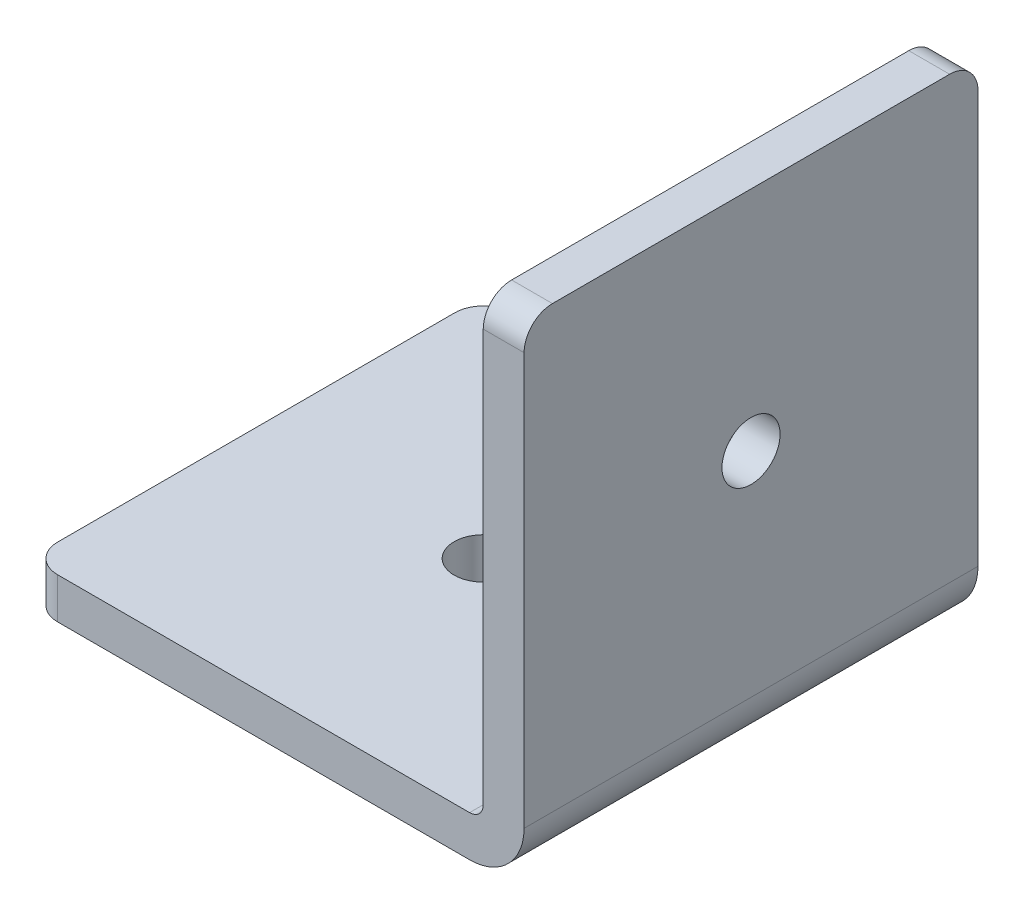
ISO-10303-21;
HEADER;
FILE_DESCRIPTION(('STEP AP214'),'2;1');
FILE_NAME('part.step','',(''),(''),'','','');
FILE_SCHEMA(('AUTOMOTIVE_DESIGN { 1 0 10303 214 1 1 1 1 }'));
ENDSEC;
DATA;
#1=APPLICATION_CONTEXT('core data for automotive mechanical design processes');
#2=APPLICATION_PROTOCOL_DEFINITION('international standard','automotive_design',2000,#1);
#3=PRODUCT_CONTEXT('',#1,'mechanical');
#4=PRODUCT('Part','Part','',(#3));
#5=PRODUCT_RELATED_PRODUCT_CATEGORY('part','',(#4));
#6=PRODUCT_DEFINITION_FORMATION('','',#4);
#7=PRODUCT_DEFINITION_CONTEXT('part definition',#1,'design');
#8=PRODUCT_DEFINITION('design','',#6,#7);
#9=PRODUCT_DEFINITION_SHAPE('','',#8);
#10=(LENGTH_UNIT() NAMED_UNIT(*) SI_UNIT(.MILLI.,.METRE.));
#11=(NAMED_UNIT(*) PLANE_ANGLE_UNIT() SI_UNIT($,.RADIAN.));
#12=(NAMED_UNIT(*) SI_UNIT($,.STERADIAN.) SOLID_ANGLE_UNIT());
#13=UNCERTAINTY_MEASURE_WITH_UNIT(LENGTH_MEASURE(1.E-05),#10,'distance_accuracy_value','');
#14=(GEOMETRIC_REPRESENTATION_CONTEXT(3) GLOBAL_UNCERTAINTY_ASSIGNED_CONTEXT((#13)) GLOBAL_UNIT_ASSIGNED_CONTEXT((#10,
#11,#12)) REPRESENTATION_CONTEXT('',''));
#15=CARTESIAN_POINT('',(0.,0.,0.));
#16=DIRECTION('',(0.,0.,1.));
#17=DIRECTION('',(1.,0.,0.));
#18=AXIS2_PLACEMENT_3D('',#15,#16,#17);
#19=CARTESIAN_POINT('',(25.4,27.686,-23.8125));
#20=DIRECTION('',(0.,-1.,0.));
#21=DIRECTION('',(1.,0.,0.));
#22=AXIS2_PLACEMENT_3D('',#19,#20,#21);
#23=PLANE('',#22);
#24=DIRECTION('',(1.,0.,0.));
#25=VECTOR('',#24,1.);
#26=CARTESIAN_POINT('',(26.543,27.686,-23.8125000006512));
#27=LINE('',#26,#25);
#28=CARTESIAN_POINT('',(27.686,27.686,-23.8125000003256));
#29=VERTEX_POINT('',#28);
#30=CARTESIAN_POINT('',(25.4,27.686,-23.8125000003256));
#31=VERTEX_POINT('',#30);
#32=EDGE_CURVE('E90',#29,#31,#27,.F.);
#33=ORIENTED_EDGE('',*,*,#32,.T.);
#34=DIRECTION('',(0.,0.,-1.));
#35=VECTOR('',#34,1.);
#36=CARTESIAN_POINT('',(25.4,27.686,-12.7));
#37=LINE('',#36,#35);
#38=CARTESIAN_POINT('',(25.4,27.686,-1.5875000003256));
#39=VERTEX_POINT('',#38);
#40=EDGE_CURVE('E80',#39,#31,#37,.T.);
#41=ORIENTED_EDGE('',*,*,#40,.F.);
#42=DIRECTION('',(-1.,0.,0.));
#43=VECTOR('',#42,1.);
#44=CARTESIAN_POINT('',(26.543,27.686,-1.5875000006512));
#45=LINE('',#44,#43);
#46=CARTESIAN_POINT('',(27.686,27.686,-1.5875000003256));
#47=VERTEX_POINT('',#46);
#48=EDGE_CURVE('E106',#39,#47,#45,.F.);
#49=ORIENTED_EDGE('',*,*,#48,.T.);
#50=DIRECTION('',(0.,0.,-1.));
#51=VECTOR('',#50,1.);
#52=CARTESIAN_POINT('',(27.686,27.686,-12.7));
#53=LINE('',#52,#51);
#54=EDGE_CURVE('E94',#47,#29,#53,.T.);
#55=ORIENTED_EDGE('',*,*,#54,.T.);
#56=EDGE_LOOP('',(#33,#41,#49,#55));
#57=FACE_BOUND('',#56,.T.);
#58=ADVANCED_FACE('F17',(#57),#23,.F.);
#59=CARTESIAN_POINT('',(27.686,14.986,-12.7));
#60=DIRECTION('',(-1.,0.,0.));
#61=DIRECTION('',(0.,0.,1.));
#62=AXIS2_PLACEMENT_3D('',#59,#60,#61);
#63=CYLINDRICAL_SURFACE('',#62,1.6256);
#64=CARTESIAN_POINT('',(25.4,14.986,-12.7));
#65=DIRECTION('',(-1.,0.,0.));
#66=DIRECTION('',(0.,0.,1.));
#67=AXIS2_PLACEMENT_3D('',#64,#65,#66);
#68=CIRCLE('',#67,1.6256);
#69=CARTESIAN_POINT('',(25.4,14.986,-11.0744));
#70=VERTEX_POINT('',#69);
#71=EDGE_CURVE('E102',#70,#70,#68,.F.);
#72=ORIENTED_EDGE('',*,*,#71,.F.);
#73=EDGE_LOOP('',(#72));
#74=FACE_BOUND('',#73,.T.);
#75=CARTESIAN_POINT('',(27.686,14.986,-12.7));
#76=DIRECTION('',(-1.,0.,0.));
#77=DIRECTION('',(0.,0.,1.));
#78=AXIS2_PLACEMENT_3D('',#75,#76,#77);
#79=CIRCLE('',#78,1.6256);
#80=CARTESIAN_POINT('',(27.686,14.986,-11.0744));
#81=VERTEX_POINT('',#80);
#82=EDGE_CURVE('E114',#81,#81,#79,.F.);
#83=ORIENTED_EDGE('',*,*,#82,.T.);
#84=EDGE_LOOP('',(#83));
#85=FACE_BOUND('',#84,.T.);
#86=ADVANCED_FACE('F371',(#74,#85),#63,.F.);
#87=CARTESIAN_POINT('',(27.686,26.0985,-23.8125));
#88=DIRECTION('',(-1.,0.,0.));
#89=DIRECTION('',(0.,0.,1.));
#90=AXIS2_PLACEMENT_3D('',#87,#88,#89);
#91=CYLINDRICAL_SURFACE('',#90,1.58749999999999);
#92=CARTESIAN_POINT('',(27.686,26.0985,-23.8125));
#93=DIRECTION('',(-1.,0.,0.));
#94=DIRECTION('',(0.,0.,1.));
#95=AXIS2_PLACEMENT_3D('',#92,#93,#94);
#96=CIRCLE('',#95,1.58749999999999);
#97=CARTESIAN_POINT('',(27.686,26.0985,-25.4));
#98=VERTEX_POINT('',#97);
#99=EDGE_CURVE('E112',#29,#98,#96,.T.);
#100=ORIENTED_EDGE('',*,*,#99,.T.);
#101=DIRECTION('',(-1.,0.,0.));
#102=VECTOR('',#101,1.);
#103=CARTESIAN_POINT('',(14.63675,26.0985,-25.4));
#104=LINE('',#103,#102);
#105=CARTESIAN_POINT('',(25.3999999983807,26.0985,-25.4));
#106=VERTEX_POINT('',#105);
#107=EDGE_CURVE('E101',#98,#106,#104,.T.);
#108=ORIENTED_EDGE('',*,*,#107,.T.);
#109=CARTESIAN_POINT('',(25.4,26.0985,-23.8125));
#110=DIRECTION('',(-1.,0.,0.));
#111=DIRECTION('',(0.,0.,1.));
#112=AXIS2_PLACEMENT_3D('',#109,#110,#111);
#113=CIRCLE('',#112,1.58749999999999);
#114=EDGE_CURVE('E21',#31,#106,#113,.T.);
#115=ORIENTED_EDGE('',*,*,#114,.F.);
#116=ORIENTED_EDGE('',*,*,#32,.F.);
#117=EDGE_LOOP('',(#100,#108,#115,#116));
#118=FACE_BOUND('',#117,.T.);
#119=ADVANCED_FACE('F99',(#118),#91,.T.);
#120=CARTESIAN_POINT('',(25.4,27.686,-25.4));
#121=DIRECTION('',(-1.,0.,0.));
#122=DIRECTION('',(0.,-1.,0.));
#123=AXIS2_PLACEMENT_3D('',#120,#121,#122);
#124=PLANE('',#123);
#125=ORIENTED_EDGE('',*,*,#71,.T.);
#126=EDGE_LOOP('',(#125));
#127=FACE_BOUND('',#126,.T.);
#128=ORIENTED_EDGE('',*,*,#114,.T.);
#129=DIRECTION('',(0.,-1.,0.));
#130=VECTOR('',#129,1.);
#131=CARTESIAN_POINT('',(25.3999999967615,13.04925,-25.4));
#132=LINE('',#131,#130);
#133=CARTESIAN_POINT('',(25.3999999983808,3.04799999984371,-25.4));
#134=VERTEX_POINT('',#133);
#135=EDGE_CURVE('E156',#106,#134,#132,.T.);
#136=ORIENTED_EDGE('',*,*,#135,.T.);
#137=DIRECTION('',(0.,0.,1.));
#138=VECTOR('',#137,1.);
#139=CARTESIAN_POINT('',(25.4,3.04799999968742,-12.7));
#140=LINE('',#139,#138);
#141=CARTESIAN_POINT('',(25.3999999983808,3.04799999984371,0.));
#142=VERTEX_POINT('',#141);
#143=EDGE_CURVE('E126',#142,#134,#140,.F.);
#144=ORIENTED_EDGE('',*,*,#143,.F.);
#145=DIRECTION('',(0.,1.,0.));
#146=VECTOR('',#145,1.);
#147=CARTESIAN_POINT('',(25.3999999967615,13.04925,0.));
#148=LINE('',#147,#146);
#149=CARTESIAN_POINT('',(25.3999999983807,26.0985,0.));
#150=VERTEX_POINT('',#149);
#151=EDGE_CURVE('E128',#142,#150,#148,.T.);
#152=ORIENTED_EDGE('',*,*,#151,.T.);
#153=CARTESIAN_POINT('',(25.4,26.0985,-1.5875));
#154=DIRECTION('',(-1.,0.,0.));
#155=DIRECTION('',(0.,0.,1.));
#156=AXIS2_PLACEMENT_3D('',#153,#154,#155);
#157=CIRCLE('',#156,1.58749999999999);
#158=EDGE_CURVE('E87',#150,#39,#157,.T.);
#159=ORIENTED_EDGE('',*,*,#158,.T.);
#160=ORIENTED_EDGE('',*,*,#40,.T.);
#161=EDGE_LOOP('',(#128,#136,#144,#152,#159,#160));
#162=FACE_BOUND('',#161,.T.);
#163=ADVANCED_FACE('F82',(#127,#162),#124,.T.);
#164=CARTESIAN_POINT('',(27.686,26.0985,-1.5875));
#165=DIRECTION('',(-1.,0.,0.));
#166=DIRECTION('',(0.,0.,1.));
#167=AXIS2_PLACEMENT_3D('',#164,#165,#166);
#168=CYLINDRICAL_SURFACE('',#167,1.58749999999999);
#169=CARTESIAN_POINT('',(27.686,26.0985,-1.5875));
#170=DIRECTION('',(-1.,0.,0.));
#171=DIRECTION('',(0.,0.,1.));
#172=AXIS2_PLACEMENT_3D('',#169,#170,#171);
#173=CIRCLE('',#172,1.58749999999999);
#174=CARTESIAN_POINT('',(27.686,26.0985,0.));
#175=VERTEX_POINT('',#174);
#176=EDGE_CURVE('E109',#175,#47,#173,.T.);
#177=ORIENTED_EDGE('',*,*,#176,.T.);
#178=ORIENTED_EDGE('',*,*,#48,.F.);
#179=ORIENTED_EDGE('',*,*,#158,.F.);
#180=DIRECTION('',(1.,0.,0.));
#181=VECTOR('',#180,1.);
#182=CARTESIAN_POINT('',(14.63675,26.0985,0.));
#183=LINE('',#182,#181);
#184=EDGE_CURVE('E158',#150,#175,#183,.T.);
#185=ORIENTED_EDGE('',*,*,#184,.T.);
#186=EDGE_LOOP('',(#177,#178,#179,#185));
#187=FACE_BOUND('',#186,.T.);
#188=ADVANCED_FACE('F245',(#187),#168,.T.);
#189=CARTESIAN_POINT('',(27.686,27.686,-25.4));
#190=DIRECTION('',(-1.,0.,0.));
#191=DIRECTION('',(0.,-1.,0.));
#192=AXIS2_PLACEMENT_3D('',#189,#190,#191);
#193=PLANE('',#192);
#194=ORIENTED_EDGE('',*,*,#82,.F.);
#195=EDGE_LOOP('',(#194));
#196=FACE_BOUND('',#195,.T.);
#197=DIRECTION('',(0.,0.,1.));
#198=VECTOR('',#197,1.);
#199=CARTESIAN_POINT('',(27.686,3.04799999874969,-12.7));
#200=LINE('',#199,#198);
#201=CARTESIAN_POINT('',(27.686,3.04799999937484,0.));
#202=VERTEX_POINT('',#201);
#203=CARTESIAN_POINT('',(27.686,3.04799999937484,-25.4));
#204=VERTEX_POINT('',#203);
#205=EDGE_CURVE('E117',#202,#204,#200,.F.);
#206=ORIENTED_EDGE('',*,*,#205,.T.);
#207=DIRECTION('',(0.,1.,0.));
#208=VECTOR('',#207,1.);
#209=CARTESIAN_POINT('',(27.686,13.04925,-25.4));
#210=LINE('',#209,#208);
#211=EDGE_CURVE('E121',#204,#98,#210,.T.);
#212=ORIENTED_EDGE('',*,*,#211,.T.);
#213=ORIENTED_EDGE('',*,*,#99,.F.);
#214=ORIENTED_EDGE('',*,*,#54,.F.);
#215=ORIENTED_EDGE('',*,*,#176,.F.);
#216=DIRECTION('',(0.,-1.,0.));
#217=VECTOR('',#216,1.);
#218=CARTESIAN_POINT('',(27.686,13.04925,0.));
#219=LINE('',#218,#217);
#220=EDGE_CURVE('E133',#175,#202,#219,.T.);
#221=ORIENTED_EDGE('',*,*,#220,.T.);
#222=EDGE_LOOP('',(#206,#212,#213,#214,#215,#221));
#223=FACE_BOUND('',#222,.T.);
#224=ADVANCED_FACE('F243',(#196,#223),#193,.F.);
#225=CARTESIAN_POINT('',(24.638,3.048,0.));
#226=DIRECTION('',(0.,0.,-1.));
#227=DIRECTION('',(-1.,0.,0.));
#228=AXIS2_PLACEMENT_3D('',#225,#226,#227);
#229=CYLINDRICAL_SURFACE('',#228,3.048);
#230=DIRECTION('',(0.,0.,1.));
#231=VECTOR('',#230,1.);
#232=CARTESIAN_POINT('',(24.638,0.,-12.7));
#233=LINE('',#232,#231);
#234=CARTESIAN_POINT('',(24.638,0.,-25.4));
#235=VERTEX_POINT('',#234);
#236=CARTESIAN_POINT('',(24.638,0.,0.));
#237=VERTEX_POINT('',#236);
#238=EDGE_CURVE('E132',#235,#237,#233,.T.);
#239=ORIENTED_EDGE('',*,*,#238,.F.);
#240=CARTESIAN_POINT('',(24.638,3.048,-25.4));
#241=DIRECTION('',(0.,0.,-1.));
#242=DIRECTION('',(-1.,0.,0.));
#243=AXIS2_PLACEMENT_3D('',#240,#241,#242);
#244=CIRCLE('',#243,3.048);
#245=EDGE_CURVE('E118',#235,#204,#244,.F.);
#246=ORIENTED_EDGE('',*,*,#245,.T.);
#247=ORIENTED_EDGE('',*,*,#205,.F.);
#248=CARTESIAN_POINT('',(24.638,3.048,0.));
#249=DIRECTION('',(0.,0.,-1.));
#250=DIRECTION('',(-1.,0.,0.));
#251=AXIS2_PLACEMENT_3D('',#248,#249,#250);
#252=CIRCLE('',#251,3.048);
#253=EDGE_CURVE('E129',#202,#237,#252,.T.);
#254=ORIENTED_EDGE('',*,*,#253,.T.);
#255=EDGE_LOOP('',(#239,#246,#247,#254));
#256=FACE_BOUND('',#255,.T.);
#257=ADVANCED_FACE('F238',(#256),#229,.T.);
#258=CARTESIAN_POINT('',(1.5875,0.,-1.5875));
#259=DIRECTION('',(0.,1.,0.));
#260=DIRECTION('',(0.,0.,1.));
#261=AXIS2_PLACEMENT_3D('',#258,#259,#260);
#262=CYLINDRICAL_SURFACE('',#261,1.5875);
#263=CARTESIAN_POINT('',(1.5875,0.,-1.5875));
#264=DIRECTION('',(0.,1.,0.));
#265=DIRECTION('',(0.,0.,1.));
#266=AXIS2_PLACEMENT_3D('',#263,#264,#265);
#267=CIRCLE('',#266,1.5875);
#268=CARTESIAN_POINT('',(1.5875,0.,0.));
#269=VERTEX_POINT('',#268);
#270=CARTESIAN_POINT('',(0.,0.,-1.5875));
#271=VERTEX_POINT('',#270);
#272=EDGE_CURVE('E134',#269,#271,#267,.F.);
#273=ORIENTED_EDGE('',*,*,#272,.F.);
#274=DIRECTION('',(0.,1.,0.));
#275=VECTOR('',#274,1.);
#276=CARTESIAN_POINT('',(1.5875,13.04925,0.));
#277=LINE('',#276,#275);
#278=CARTESIAN_POINT('',(1.5875,2.286,0.));
#279=VERTEX_POINT('',#278);
#280=EDGE_CURVE('E125',#269,#279,#277,.T.);
#281=ORIENTED_EDGE('',*,*,#280,.T.);
#282=CARTESIAN_POINT('',(1.5875,2.286,-1.5875));
#283=DIRECTION('',(0.,1.,0.));
#284=DIRECTION('',(0.,0.,1.));
#285=AXIS2_PLACEMENT_3D('',#282,#283,#284);
#286=CIRCLE('',#285,1.5875);
#287=CARTESIAN_POINT('',(0.,2.286,-1.5875));
#288=VERTEX_POINT('',#287);
#289=EDGE_CURVE('E143',#279,#288,#286,.F.);
#290=ORIENTED_EDGE('',*,*,#289,.T.);
#291=DIRECTION('',(0.,-1.,0.));
#292=VECTOR('',#291,1.);
#293=CARTESIAN_POINT('',(0.,1.143,-1.5875));
#294=LINE('',#293,#292);
#295=EDGE_CURVE('E163',#288,#271,#294,.T.);
#296=ORIENTED_EDGE('',*,*,#295,.T.);
#297=EDGE_LOOP('',(#273,#281,#290,#296));
#298=FACE_BOUND('',#297,.T.);
#299=ADVANCED_FACE('F273',(#298),#262,.T.);
#300=CARTESIAN_POINT('',(0.,0.,-1.5875));
#301=DIRECTION('',(1.,0.,0.));
#302=DIRECTION('',(0.,0.,-1.));
#303=AXIS2_PLACEMENT_3D('',#300,#301,#302);
#304=PLANE('',#303);
#305=DIRECTION('',(0.,1.,0.));
#306=VECTOR('',#305,1.);
#307=CARTESIAN_POINT('',(0.,1.143,-23.8125000006107));
#308=LINE('',#307,#306);
#309=CARTESIAN_POINT('',(0.,2.286,-23.8125000003053));
#310=VERTEX_POINT('',#309);
#311=CARTESIAN_POINT('',(0.,0.,-23.8125000003053));
#312=VERTEX_POINT('',#311);
#313=EDGE_CURVE('E168',#310,#312,#308,.F.);
#314=ORIENTED_EDGE('',*,*,#313,.T.);
#315=DIRECTION('',(0.,0.,-1.));
#316=VECTOR('',#315,1.);
#317=CARTESIAN_POINT('',(0.,0.,-12.7));
#318=LINE('',#317,#316);
#319=EDGE_CURVE('E137',#271,#312,#318,.T.);
#320=ORIENTED_EDGE('',*,*,#319,.F.);
#321=ORIENTED_EDGE('',*,*,#295,.F.);
#322=DIRECTION('',(0.,0.,-1.));
#323=VECTOR('',#322,1.);
#324=CARTESIAN_POINT('',(0.,2.286,-12.7));
#325=LINE('',#324,#323);
#326=EDGE_CURVE('E146',#288,#310,#325,.T.);
#327=ORIENTED_EDGE('',*,*,#326,.T.);
#328=EDGE_LOOP('',(#314,#320,#321,#327));
#329=FACE_BOUND('',#328,.T.);
#330=ADVANCED_FACE('F226',(#329),#304,.F.);
#331=CARTESIAN_POINT('',(1.5875,0.,-23.8125));
#332=DIRECTION('',(0.,1.,0.));
#333=DIRECTION('',(0.,0.,1.));
#334=AXIS2_PLACEMENT_3D('',#331,#332,#333);
#335=CYLINDRICAL_SURFACE('',#334,1.5875);
#336=CARTESIAN_POINT('',(1.5875,0.,-23.8125));
#337=DIRECTION('',(0.,1.,0.));
#338=DIRECTION('',(0.,0.,1.));
#339=AXIS2_PLACEMENT_3D('',#336,#337,#338);
#340=CIRCLE('',#339,1.5875);
#341=CARTESIAN_POINT('',(1.5875,0.,-25.4));
#342=VERTEX_POINT('',#341);
#343=EDGE_CURVE('E139',#312,#342,#340,.F.);
#344=ORIENTED_EDGE('',*,*,#343,.F.);
#345=ORIENTED_EDGE('',*,*,#313,.F.);
#346=CARTESIAN_POINT('',(1.5875,2.286,-23.8125));
#347=DIRECTION('',(0.,1.,0.));
#348=DIRECTION('',(0.,0.,1.));
#349=AXIS2_PLACEMENT_3D('',#346,#347,#348);
#350=CIRCLE('',#349,1.5875);
#351=CARTESIAN_POINT('',(1.5875,2.286,-25.4));
#352=VERTEX_POINT('',#351);
#353=EDGE_CURVE('E147',#310,#352,#350,.F.);
#354=ORIENTED_EDGE('',*,*,#353,.T.);
#355=DIRECTION('',(0.,-1.,0.));
#356=VECTOR('',#355,1.);
#357=CARTESIAN_POINT('',(1.5875,13.04925,-25.4));
#358=LINE('',#357,#356);
#359=EDGE_CURVE('E122',#352,#342,#358,.T.);
#360=ORIENTED_EDGE('',*,*,#359,.T.);
#361=EDGE_LOOP('',(#344,#345,#354,#360));
#362=FACE_BOUND('',#361,.T.);
#363=ADVANCED_FACE('F221',(#362),#335,.T.);
#364=CARTESIAN_POINT('',(1.5875,0.,-25.4));
#365=DIRECTION('',(0.,0.,1.));
#366=DIRECTION('',(1.,0.,0.));
#367=AXIS2_PLACEMENT_3D('',#364,#365,#366);
#368=PLANE('',#367);
#369=CARTESIAN_POINT('',(24.638,3.048,-25.4));
#370=DIRECTION('',(0.,0.,-1.));
#371=DIRECTION('',(-1.,0.,0.));
#372=AXIS2_PLACEMENT_3D('',#369,#370,#371);
#373=CIRCLE('',#372,0.762000000000002);
#374=CARTESIAN_POINT('',(24.638,2.286,-25.4));
#375=VERTEX_POINT('',#374);
#376=EDGE_CURVE('E123',#134,#375,#373,.T.);
#377=ORIENTED_EDGE('',*,*,#376,.F.);
#378=ORIENTED_EDGE('',*,*,#135,.F.);
#379=ORIENTED_EDGE('',*,*,#107,.F.);
#380=ORIENTED_EDGE('',*,*,#211,.F.);
#381=ORIENTED_EDGE('',*,*,#245,.F.);
#382=DIRECTION('',(1.,0.,0.));
#383=VECTOR('',#382,1.);
#384=CARTESIAN_POINT('',(12.319,0.,-25.4));
#385=LINE('',#384,#383);
#386=EDGE_CURVE('E142',#342,#235,#385,.T.);
#387=ORIENTED_EDGE('',*,*,#386,.F.);
#388=ORIENTED_EDGE('',*,*,#359,.F.);
#389=DIRECTION('',(1.,0.,0.));
#390=VECTOR('',#389,1.);
#391=CARTESIAN_POINT('',(12.319,2.286,-25.4));
#392=LINE('',#391,#390);
#393=EDGE_CURVE('E150',#352,#375,#392,.T.);
#394=ORIENTED_EDGE('',*,*,#393,.T.);
#395=EDGE_LOOP('',(#377,#378,#379,#380,#381,#387,#388,#394));
#396=FACE_BOUND('',#395,.T.);
#397=ADVANCED_FACE('F212',(#396),#368,.F.);
#398=CARTESIAN_POINT('',(24.638,3.048,0.));
#399=DIRECTION('',(0.,0.,-1.));
#400=DIRECTION('',(-1.,0.,0.));
#401=AXIS2_PLACEMENT_3D('',#398,#399,#400);
#402=CYLINDRICAL_SURFACE('',#401,0.762000000000002);
#403=DIRECTION('',(0.,0.,1.));
#404=VECTOR('',#403,1.);
#405=CARTESIAN_POINT('',(24.638,2.286,-12.7));
#406=LINE('',#405,#404);
#407=CARTESIAN_POINT('',(24.638,2.286,0.));
#408=VERTEX_POINT('',#407);
#409=EDGE_CURVE('E178',#375,#408,#406,.T.);
#410=ORIENTED_EDGE('',*,*,#409,.T.);
#411=CARTESIAN_POINT('',(24.638,3.048,0.));
#412=DIRECTION('',(0.,0.,-1.));
#413=DIRECTION('',(-1.,0.,0.));
#414=AXIS2_PLACEMENT_3D('',#411,#412,#413);
#415=CIRCLE('',#414,0.762000000000002);
#416=EDGE_CURVE('E36',#408,#142,#415,.F.);
#417=ORIENTED_EDGE('',*,*,#416,.T.);
#418=ORIENTED_EDGE('',*,*,#143,.T.);
#419=ORIENTED_EDGE('',*,*,#376,.T.);
#420=EDGE_LOOP('',(#410,#417,#418,#419));
#421=FACE_BOUND('',#420,.T.);
#422=ADVANCED_FACE('F209',(#421),#402,.F.);
#423=CARTESIAN_POINT('',(27.686,0.,0.));
#424=DIRECTION('',(0.,0.,-1.));
#425=DIRECTION('',(-1.,0.,0.));
#426=AXIS2_PLACEMENT_3D('',#423,#424,#425);
#427=PLANE('',#426);
#428=ORIENTED_EDGE('',*,*,#253,.F.);
#429=ORIENTED_EDGE('',*,*,#220,.F.);
#430=ORIENTED_EDGE('',*,*,#184,.F.);
#431=ORIENTED_EDGE('',*,*,#151,.F.);
#432=ORIENTED_EDGE('',*,*,#416,.F.);
#433=DIRECTION('',(-1.,0.,0.));
#434=VECTOR('',#433,1.);
#435=CARTESIAN_POINT('',(12.319,2.286,0.));
#436=LINE('',#435,#434);
#437=EDGE_CURVE('E152',#408,#279,#436,.T.);
#438=ORIENTED_EDGE('',*,*,#437,.T.);
#439=ORIENTED_EDGE('',*,*,#280,.F.);
#440=DIRECTION('',(-1.,0.,0.));
#441=VECTOR('',#440,1.);
#442=CARTESIAN_POINT('',(12.319,0.,0.));
#443=LINE('',#442,#441);
#444=EDGE_CURVE('E138',#237,#269,#443,.T.);
#445=ORIENTED_EDGE('',*,*,#444,.F.);
#446=EDGE_LOOP('',(#428,#429,#430,#431,#432,#438,#439,#445));
#447=FACE_BOUND('',#446,.T.);
#448=ADVANCED_FACE('F197',(#447),#427,.F.);
#449=CARTESIAN_POINT('',(0.,0.,0.));
#450=DIRECTION('',(0.,-1.,0.));
#451=DIRECTION('',(0.,0.,-1.));
#452=AXIS2_PLACEMENT_3D('',#449,#450,#451);
#453=PLANE('',#452);
#454=CARTESIAN_POINT('',(12.7,0.,-12.7));
#455=DIRECTION('',(0.,1.,0.));
#456=DIRECTION('',(0.,0.,1.));
#457=AXIS2_PLACEMENT_3D('',#454,#455,#456);
#458=CIRCLE('',#457,1.6256);
#459=CARTESIAN_POINT('',(12.7,0.,-11.0744));
#460=VERTEX_POINT('',#459);
#461=EDGE_CURVE('E27',#460,#460,#458,.F.);
#462=ORIENTED_EDGE('',*,*,#461,.F.);
#463=EDGE_LOOP('',(#462));
#464=FACE_BOUND('',#463,.T.);
#465=ORIENTED_EDGE('',*,*,#343,.T.);
#466=ORIENTED_EDGE('',*,*,#386,.T.);
#467=ORIENTED_EDGE('',*,*,#238,.T.);
#468=ORIENTED_EDGE('',*,*,#444,.T.);
#469=ORIENTED_EDGE('',*,*,#272,.T.);
#470=ORIENTED_EDGE('',*,*,#319,.T.);
#471=EDGE_LOOP('',(#465,#466,#467,#468,#469,#470));
#472=FACE_BOUND('',#471,.T.);
#473=ADVANCED_FACE('F265',(#464,#472),#453,.T.);
#474=CARTESIAN_POINT('',(0.,2.286,0.));
#475=DIRECTION('',(0.,-1.,0.));
#476=DIRECTION('',(0.,0.,-1.));
#477=AXIS2_PLACEMENT_3D('',#474,#475,#476);
#478=PLANE('',#477);
#479=CARTESIAN_POINT('',(12.7,2.286,-12.7));
#480=DIRECTION('',(0.,1.,0.));
#481=DIRECTION('',(0.,0.,1.));
#482=AXIS2_PLACEMENT_3D('',#479,#480,#481);
#483=CIRCLE('',#482,1.6256);
#484=CARTESIAN_POINT('',(12.7,2.286,-11.0744));
#485=VERTEX_POINT('',#484);
#486=EDGE_CURVE('E11',#485,#485,#483,.T.);
#487=ORIENTED_EDGE('',*,*,#486,.F.);
#488=EDGE_LOOP('',(#487));
#489=FACE_BOUND('',#488,.T.);
#490=ORIENTED_EDGE('',*,*,#409,.F.);
#491=ORIENTED_EDGE('',*,*,#393,.F.);
#492=ORIENTED_EDGE('',*,*,#353,.F.);
#493=ORIENTED_EDGE('',*,*,#326,.F.);
#494=ORIENTED_EDGE('',*,*,#289,.F.);
#495=ORIENTED_EDGE('',*,*,#437,.F.);
#496=EDGE_LOOP('',(#490,#491,#492,#493,#494,#495));
#497=FACE_BOUND('',#496,.T.);
#498=ADVANCED_FACE('F19',(#489,#497),#478,.F.);
#499=CARTESIAN_POINT('',(12.7,0.,-12.7));
#500=DIRECTION('',(0.,1.,0.));
#501=DIRECTION('',(0.,0.,1.));
#502=AXIS2_PLACEMENT_3D('',#499,#500,#501);
#503=CYLINDRICAL_SURFACE('',#502,1.6256);
#504=ORIENTED_EDGE('',*,*,#486,.T.);
#505=EDGE_LOOP('',(#504));
#506=FACE_BOUND('',#505,.T.);
#507=ORIENTED_EDGE('',*,*,#461,.T.);
#508=EDGE_LOOP('',(#507));
#509=FACE_BOUND('',#508,.T.);
#510=ADVANCED_FACE('F258',(#506,#509),#503,.F.);
#511=CLOSED_SHELL('',(#58,#86,#119,#163,#188,#224,#257,#299,#330,#363,#397,#422,#448,#473,#498,#510));
#512=MANIFOLD_SOLID_BREP('B1',#511);
#513=ADVANCED_BREP_SHAPE_REPRESENTATION('',(#18,#512),#14);
#514=SHAPE_DEFINITION_REPRESENTATION(#9,#513);
ENDSEC;
END-ISO-10303-21;
